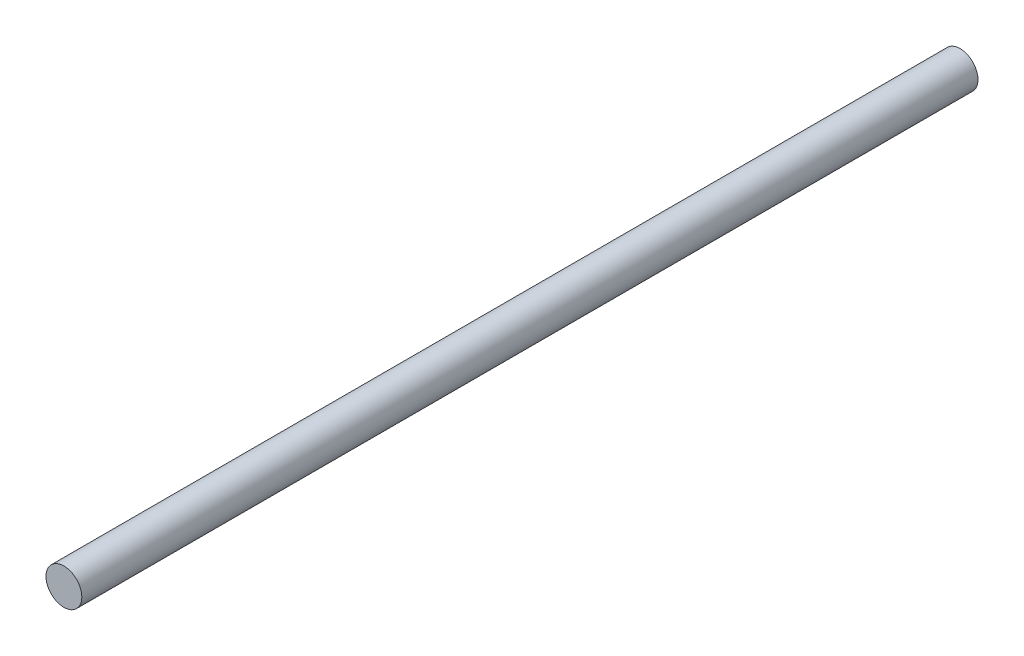
ISO-10303-21;
HEADER;
FILE_DESCRIPTION(('STEP AP214'),'2;1');
FILE_NAME('part.step','',(''),(''),'','','');
FILE_SCHEMA(('AUTOMOTIVE_DESIGN { 1 0 10303 214 1 1 1 1 }'));
ENDSEC;
DATA;
#1=APPLICATION_CONTEXT('core data for automotive mechanical design processes');
#2=APPLICATION_PROTOCOL_DEFINITION('international standard','automotive_design',2000,#1);
#3=PRODUCT_CONTEXT('',#1,'mechanical');
#4=PRODUCT('Part','Part','',(#3));
#5=PRODUCT_RELATED_PRODUCT_CATEGORY('part','',(#4));
#6=PRODUCT_DEFINITION_FORMATION('','',#4);
#7=PRODUCT_DEFINITION_CONTEXT('part definition',#1,'design');
#8=PRODUCT_DEFINITION('design','',#6,#7);
#9=PRODUCT_DEFINITION_SHAPE('','',#8);
#10=(LENGTH_UNIT() NAMED_UNIT(*) SI_UNIT(.MILLI.,.METRE.));
#11=(NAMED_UNIT(*) PLANE_ANGLE_UNIT() SI_UNIT($,.RADIAN.));
#12=(NAMED_UNIT(*) SI_UNIT($,.STERADIAN.) SOLID_ANGLE_UNIT());
#13=UNCERTAINTY_MEASURE_WITH_UNIT(LENGTH_MEASURE(1.E-05),#10,'distance_accuracy_value','');
#14=(GEOMETRIC_REPRESENTATION_CONTEXT(3) GLOBAL_UNCERTAINTY_ASSIGNED_CONTEXT((#13)) GLOBAL_UNIT_ASSIGNED_CONTEXT((#10,
#11,#12)) REPRESENTATION_CONTEXT('',''));
#15=CARTESIAN_POINT('',(0.,0.,0.));
#16=DIRECTION('',(0.,0.,1.));
#17=DIRECTION('',(1.,0.,0.));
#18=AXIS2_PLACEMENT_3D('',#15,#16,#17);
#19=CARTESIAN_POINT('',(-1.3,7.00000000000402,-16.2));
#20=DIRECTION('',(0.,0.,1.));
#21=DIRECTION('',(1.,0.,0.));
#22=AXIS2_PLACEMENT_3D('',#19,#20,#21);
#23=PLANE('',#22);
#24=CARTESIAN_POINT('',(-1.3,7.00000000000402,-16.2));
#25=DIRECTION('',(0.,0.,1.));
#26=DIRECTION('',(-1.,0.,0.));
#27=AXIS2_PLACEMENT_3D('',#24,#25,#26);
#28=CIRCLE('',#27,0.6);
#29=CARTESIAN_POINT('',(-0.7,7.00000000000402,-16.2));
#30=VERTEX_POINT('',#29);
#31=EDGE_CURVE('E11',#30,#30,#28,.T.);
#32=ORIENTED_EDGE('',*,*,#31,.F.);
#33=EDGE_LOOP('',(#32));
#34=FACE_BOUND('',#33,.T.);
#35=ADVANCED_FACE('F16',(#34),#23,.F.);
#36=CARTESIAN_POINT('',(-1.3,7.00000000000402,13.8));
#37=DIRECTION('',(0.,0.,1.));
#38=DIRECTION('',(1.,0.,0.));
#39=AXIS2_PLACEMENT_3D('',#36,#37,#38);
#40=PLANE('',#39);
#41=CARTESIAN_POINT('',(-1.3,7.00000000000402,13.8));
#42=DIRECTION('',(0.,0.,1.));
#43=DIRECTION('',(-1.,0.,0.));
#44=AXIS2_PLACEMENT_3D('',#41,#42,#43);
#45=CIRCLE('',#44,0.6);
#46=CARTESIAN_POINT('',(-0.7,7.00000000000402,13.8));
#47=VERTEX_POINT('',#46);
#48=EDGE_CURVE('E20',#47,#47,#45,.T.);
#49=ORIENTED_EDGE('',*,*,#48,.T.);
#50=EDGE_LOOP('',(#49));
#51=FACE_BOUND('',#50,.T.);
#52=ADVANCED_FACE('F44',(#51),#40,.T.);
#53=CARTESIAN_POINT('',(-1.3,7.00000000000402,-16.2));
#54=DIRECTION('',(0.,0.,1.));
#55=DIRECTION('',(-1.,0.,0.));
#56=AXIS2_PLACEMENT_3D('',#53,#54,#55);
#57=CYLINDRICAL_SURFACE('',#56,0.6);
#58=ORIENTED_EDGE('',*,*,#48,.F.);
#59=DIRECTION('',(0.,0.,-1.));
#60=VECTOR('',#59,1.);
#61=CARTESIAN_POINT('',(-0.7,7.00000000000402,-16.2));
#62=LINE('',#61,#60);
#63=EDGE_CURVE('E27',#47,#30,#62,.T.);
#64=ORIENTED_EDGE('',*,*,#63,.T.);
#65=ORIENTED_EDGE('',*,*,#31,.T.);
#66=ORIENTED_EDGE('',*,*,#63,.F.);
#67=EDGE_LOOP('',(#58,#64,#65,#66));
#68=FACE_BOUND('',#67,.T.);
#69=ADVANCED_FACE('F18',(#68),#57,.T.);
#70=CLOSED_SHELL('',(#35,#52,#69));
#71=MANIFOLD_SOLID_BREP('B1',#70);
#72=ADVANCED_BREP_SHAPE_REPRESENTATION('',(#18,#71),#14);
#73=SHAPE_DEFINITION_REPRESENTATION(#9,#72);
ENDSEC;
END-ISO-10303-21;
